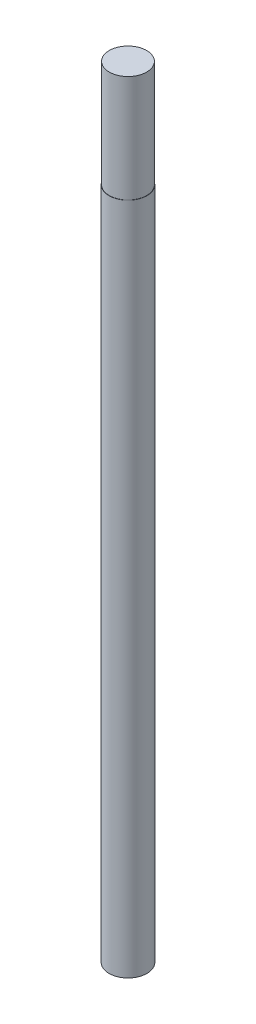
ISO-10303-21;
HEADER;
FILE_DESCRIPTION(('STEP AP214'),'2;1');
FILE_NAME('part.step','',(''),(''),'','','');
FILE_SCHEMA(('AUTOMOTIVE_DESIGN { 1 0 10303 214 1 1 1 1 }'));
ENDSEC;
DATA;
#1=APPLICATION_CONTEXT('core data for automotive mechanical design processes');
#2=APPLICATION_PROTOCOL_DEFINITION('international standard','automotive_design',2000,#1);
#3=PRODUCT_CONTEXT('',#1,'mechanical');
#4=PRODUCT('Part','Part','',(#3));
#5=PRODUCT_RELATED_PRODUCT_CATEGORY('part','',(#4));
#6=PRODUCT_DEFINITION_FORMATION('','',#4);
#7=PRODUCT_DEFINITION_CONTEXT('part definition',#1,'design');
#8=PRODUCT_DEFINITION('design','',#6,#7);
#9=PRODUCT_DEFINITION_SHAPE('','',#8);
#10=(LENGTH_UNIT() NAMED_UNIT(*) SI_UNIT(.MILLI.,.METRE.));
#11=(NAMED_UNIT(*) PLANE_ANGLE_UNIT() SI_UNIT($,.RADIAN.));
#12=(NAMED_UNIT(*) SI_UNIT($,.STERADIAN.) SOLID_ANGLE_UNIT());
#13=UNCERTAINTY_MEASURE_WITH_UNIT(LENGTH_MEASURE(1.E-05),#10,'distance_accuracy_value','');
#14=(GEOMETRIC_REPRESENTATION_CONTEXT(3) GLOBAL_UNCERTAINTY_ASSIGNED_CONTEXT((#13)) GLOBAL_UNIT_ASSIGNED_CONTEXT((#10,
#11,#12)) REPRESENTATION_CONTEXT('',''));
#15=CARTESIAN_POINT('',(0.,0.,0.));
#16=DIRECTION('',(0.,0.,1.));
#17=DIRECTION('',(1.,0.,0.));
#18=AXIS2_PLACEMENT_3D('',#15,#16,#17);
#19=CARTESIAN_POINT('',(0.,126.,0.));
#20=DIRECTION('',(0.,1.,0.));
#21=DIRECTION('',(0.,0.,1.));
#22=AXIS2_PLACEMENT_3D('',#19,#20,#21);
#23=PLANE('',#22);
#24=CARTESIAN_POINT('',(0.,126.,0.));
#25=DIRECTION('',(0.,1.,0.));
#26=DIRECTION('',(0.,0.,1.));
#27=AXIS2_PLACEMENT_3D('',#24,#25,#26);
#28=CIRCLE('',#27,3.55);
#29=CARTESIAN_POINT('',(0.,126.,3.55));
#30=VERTEX_POINT('',#29);
#31=EDGE_CURVE('E10',#30,#30,#28,.T.);
#32=ORIENTED_EDGE('',*,*,#31,.T.);
#33=EDGE_LOOP('',(#32));
#34=FACE_BOUND('',#33,.T.);
#35=CARTESIAN_POINT('',(0.,126.,0.));
#36=DIRECTION('',(0.,1.,0.));
#37=DIRECTION('',(0.,0.,1.));
#38=AXIS2_PLACEMENT_3D('',#35,#36,#37);
#39=CIRCLE('',#38,3.5);
#40=CARTESIAN_POINT('',(0.,126.,3.5));
#41=VERTEX_POINT('',#40);
#42=EDGE_CURVE('E44',#41,#41,#39,.T.);
#43=ORIENTED_EDGE('',*,*,#42,.F.);
#44=EDGE_LOOP('',(#43));
#45=FACE_BOUND('',#44,.T.);
#46=ADVANCED_FACE('F31',(#34,#45),#23,.T.);
#47=CARTESIAN_POINT('',(0.,126.,0.));
#48=DIRECTION('',(0.,-1.,0.));
#49=DIRECTION('',(0.,0.,-1.));
#50=AXIS2_PLACEMENT_3D('',#47,#48,#49);
#51=CYLINDRICAL_SURFACE('',#50,3.55);
#52=ORIENTED_EDGE('',*,*,#31,.F.);
#53=EDGE_LOOP('',(#52));
#54=FACE_BOUND('',#53,.T.);
#55=CARTESIAN_POINT('',(0.,0.,0.));
#56=DIRECTION('',(0.,1.,0.));
#57=DIRECTION('',(0.,0.,1.));
#58=AXIS2_PLACEMENT_3D('',#55,#56,#57);
#59=CIRCLE('',#58,3.55);
#60=CARTESIAN_POINT('',(0.,0.,3.55));
#61=VERTEX_POINT('',#60);
#62=EDGE_CURVE('E35',#61,#61,#59,.T.);
#63=ORIENTED_EDGE('',*,*,#62,.T.);
#64=EDGE_LOOP('',(#63));
#65=FACE_BOUND('',#64,.T.);
#66=ADVANCED_FACE('F33',(#54,#65),#51,.T.);
#67=CARTESIAN_POINT('',(0.,0.,0.));
#68=DIRECTION('',(0.,1.,0.));
#69=DIRECTION('',(0.,0.,1.));
#70=AXIS2_PLACEMENT_3D('',#67,#68,#69);
#71=PLANE('',#70);
#72=ORIENTED_EDGE('',*,*,#62,.F.);
#73=EDGE_LOOP('',(#72));
#74=FACE_BOUND('',#73,.T.);
#75=ADVANCED_FACE('F55',(#74),#71,.F.);
#76=CARTESIAN_POINT('',(0.,146.,0.));
#77=DIRECTION('',(0.,-1.,0.));
#78=DIRECTION('',(0.,0.,-1.));
#79=AXIS2_PLACEMENT_3D('',#76,#77,#78);
#80=CYLINDRICAL_SURFACE('',#79,3.5);
#81=CARTESIAN_POINT('',(0.,146.,0.));
#82=DIRECTION('',(0.,1.,0.));
#83=DIRECTION('',(0.,0.,1.));
#84=AXIS2_PLACEMENT_3D('',#81,#82,#83);
#85=CIRCLE('',#84,3.5);
#86=CARTESIAN_POINT('',(0.,146.,3.5));
#87=VERTEX_POINT('',#86);
#88=EDGE_CURVE('E42',#87,#87,#85,.T.);
#89=ORIENTED_EDGE('',*,*,#88,.F.);
#90=EDGE_LOOP('',(#89));
#91=FACE_BOUND('',#90,.T.);
#92=ORIENTED_EDGE('',*,*,#42,.T.);
#93=EDGE_LOOP('',(#92));
#94=FACE_BOUND('',#93,.T.);
#95=ADVANCED_FACE('F52',(#91,#94),#80,.T.);
#96=CARTESIAN_POINT('',(0.,146.,0.));
#97=DIRECTION('',(0.,1.,0.));
#98=DIRECTION('',(0.,0.,1.));
#99=AXIS2_PLACEMENT_3D('',#96,#97,#98);
#100=PLANE('',#99);
#101=ORIENTED_EDGE('',*,*,#88,.T.);
#102=EDGE_LOOP('',(#101));
#103=FACE_BOUND('',#102,.T.);
#104=ADVANCED_FACE('F50',(#103),#100,.T.);
#105=CLOSED_SHELL('',(#46,#66,#75,#95,#104));
#106=MANIFOLD_SOLID_BREP('B2',#105);
#107=ADVANCED_BREP_SHAPE_REPRESENTATION('',(#18,#106),#14);
#108=SHAPE_DEFINITION_REPRESENTATION(#9,#107);
ENDSEC;
END-ISO-10303-21;
